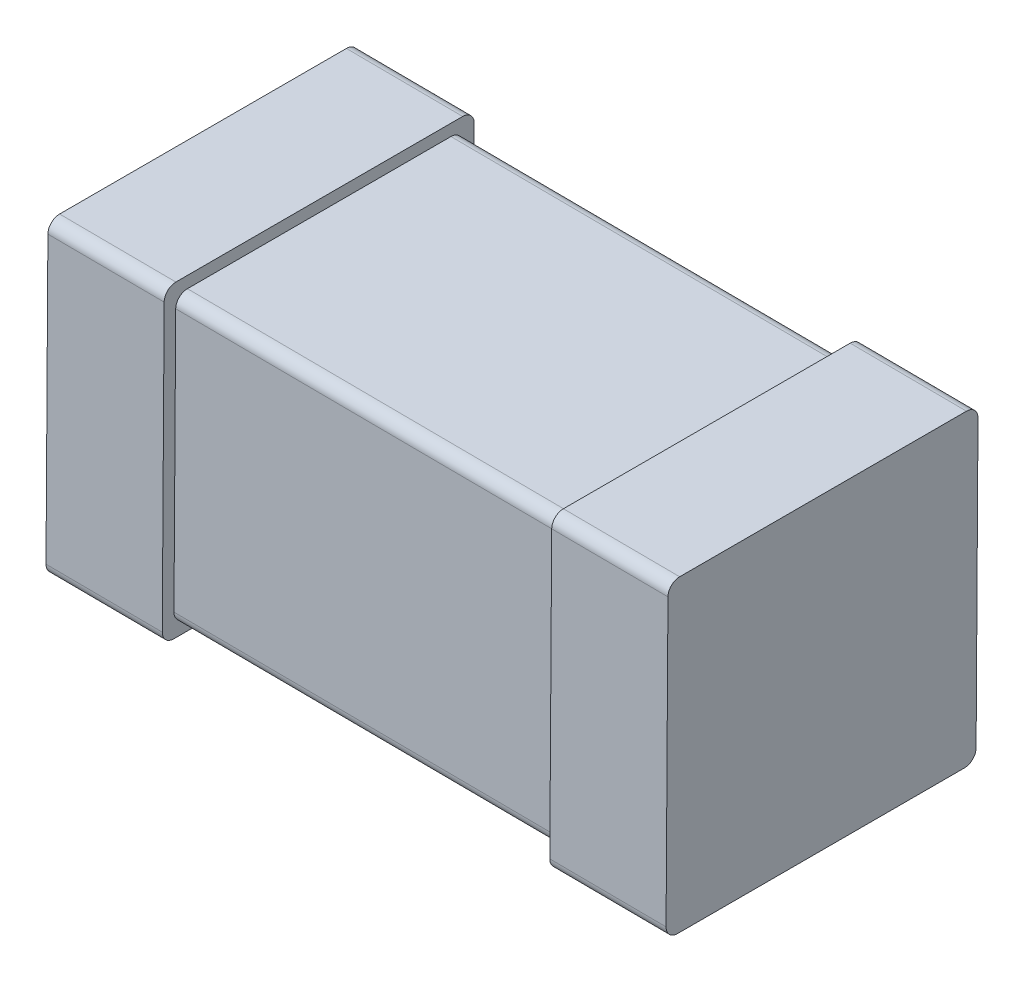
ISO-10303-21;
HEADER;
FILE_DESCRIPTION(('STEP AP214'),'2;1');
FILE_NAME('part.step','',(''),(''),'','','');
FILE_SCHEMA(('AUTOMOTIVE_DESIGN { 1 0 10303 214 1 1 1 1 }'));
ENDSEC;
DATA;
#1=APPLICATION_CONTEXT('core data for automotive mechanical design processes');
#2=APPLICATION_PROTOCOL_DEFINITION('international standard','automotive_design',2000,#1);
#3=PRODUCT_CONTEXT('',#1,'mechanical');
#4=PRODUCT('Part','Part','',(#3));
#5=PRODUCT_RELATED_PRODUCT_CATEGORY('part','',(#4));
#6=PRODUCT_DEFINITION_FORMATION('','',#4);
#7=PRODUCT_DEFINITION_CONTEXT('part definition',#1,'design');
#8=PRODUCT_DEFINITION('design','',#6,#7);
#9=PRODUCT_DEFINITION_SHAPE('','',#8);
#10=(LENGTH_UNIT() NAMED_UNIT(*) SI_UNIT(.MILLI.,.METRE.));
#11=(NAMED_UNIT(*) PLANE_ANGLE_UNIT() SI_UNIT($,.RADIAN.));
#12=(NAMED_UNIT(*) SI_UNIT($,.STERADIAN.) SOLID_ANGLE_UNIT());
#13=UNCERTAINTY_MEASURE_WITH_UNIT(LENGTH_MEASURE(1.E-05),#10,'distance_accuracy_value','');
#14=(GEOMETRIC_REPRESENTATION_CONTEXT(3) GLOBAL_UNCERTAINTY_ASSIGNED_CONTEXT((#13)) GLOBAL_UNIT_ASSIGNED_CONTEXT((#10,
#11,#12)) REPRESENTATION_CONTEXT('',''));
#15=CARTESIAN_POINT('',(0.,0.,0.));
#16=DIRECTION('',(0.,0.,1.));
#17=DIRECTION('',(1.,0.,0.));
#18=AXIS2_PLACEMENT_3D('',#15,#16,#17);
#19=CARTESIAN_POINT('',(187.003035032281,101.376564461383,142.211582908599));
#20=DIRECTION('',(0.99997801670857,-0.00663069374923689,0.));
#21=DIRECTION('',(0.,0.,-1.));
#22=AXIS2_PLACEMENT_3D('',#19,#20,#21);
#23=PLANE('',#22);
#24=DIRECTION('',(0.,0.,1.));
#25=VECTOR('',#24,1.);
#26=CARTESIAN_POINT('',(187.003035032281,101.376564461383,142.211582908599));
#27=LINE('',#26,#25);
#28=CARTESIAN_POINT('',(187.003035032281,101.376564461383,142.241582908599));
#29=VERTEX_POINT('',#28);
#30=CARTESIAN_POINT('',(187.003035032281,101.376564461383,142.981582908599));
#31=VERTEX_POINT('',#30);
#32=EDGE_CURVE('E67',#29,#31,#27,.T.);
#33=ORIENTED_EDGE('',*,*,#32,.F.);
#34=CARTESIAN_POINT('',(187.003233953094,101.406563801884,142.241582908599));
#35=DIRECTION('',(0.99997801670857,-0.00663069374923689,0.));
#36=DIRECTION('',(0.,0.,1.));
#37=AXIS2_PLACEMENT_3D('',#34,#35,#36);
#38=CIRCLE('',#37,0.0300000000000023);
#39=CARTESIAN_POINT('',(187.003233953094,101.406563801884,142.211582908599));
#40=VERTEX_POINT('',#39);
#41=EDGE_CURVE('E11',#29,#40,#38,.T.);
#42=ORIENTED_EDGE('',*,*,#41,.T.);
#43=DIRECTION('',(0.00663069374923689,0.999978016708569,0.));
#44=VECTOR('',#43,1.);
#45=CARTESIAN_POINT('',(187.003035032281,101.376564461383,142.211582908599));
#46=LINE('',#45,#44);
#47=CARTESIAN_POINT('',(187.008140666468,102.146547534249,142.211582908599));
#48=VERTEX_POINT('',#47);
#49=EDGE_CURVE('E55',#40,#48,#46,.T.);
#50=ORIENTED_EDGE('',*,*,#49,.T.);
#51=CARTESIAN_POINT('',(187.008140666468,102.146547534249,142.241582908599));
#52=DIRECTION('',(-0.99997801670857,0.00663069374923689,0.));
#53=DIRECTION('',(0.,0.,1.));
#54=AXIS2_PLACEMENT_3D('',#51,#52,#53);
#55=CIRCLE('',#54,0.0300000000000023);
#56=CARTESIAN_POINT('',(187.00833958728,102.17654687475,142.241582908599));
#57=VERTEX_POINT('',#56);
#58=EDGE_CURVE('E240',#57,#48,#55,.T.);
#59=ORIENTED_EDGE('',*,*,#58,.F.);
#60=DIRECTION('',(0.,0.,1.));
#61=VECTOR('',#60,1.);
#62=CARTESIAN_POINT('',(187.00833958728,102.17654687475,142.211582908599));
#63=LINE('',#62,#61);
#64=CARTESIAN_POINT('',(187.00833958728,102.17654687475,142.981582908599));
#65=VERTEX_POINT('',#64);
#66=EDGE_CURVE('E236',#57,#65,#63,.T.);
#67=ORIENTED_EDGE('',*,*,#66,.T.);
#68=CARTESIAN_POINT('',(187.008140666468,102.146547534249,142.981582908599));
#69=DIRECTION('',(0.99997801670857,-0.00663069374923689,0.));
#70=DIRECTION('',(0.,0.,1.));
#71=AXIS2_PLACEMENT_3D('',#68,#69,#70);
#72=CIRCLE('',#71,0.0300000000000023);
#73=CARTESIAN_POINT('',(187.008140666468,102.146547534249,143.011582908599));
#74=VERTEX_POINT('',#73);
#75=EDGE_CURVE('E226',#65,#74,#72,.T.);
#76=ORIENTED_EDGE('',*,*,#75,.T.);
#77=DIRECTION('',(0.00663069374923689,0.999978016708569,0.));
#78=VECTOR('',#77,1.);
#79=CARTESIAN_POINT('',(187.003035032281,101.376564461383,143.011582908599));
#80=LINE('',#79,#78);
#81=CARTESIAN_POINT('',(187.003233953094,101.406563801884,143.011582908599));
#82=VERTEX_POINT('',#81);
#83=EDGE_CURVE('E357',#82,#74,#80,.T.);
#84=ORIENTED_EDGE('',*,*,#83,.F.);
#85=CARTESIAN_POINT('',(187.003233953094,101.406563801884,142.981582908599));
#86=DIRECTION('',(-0.99997801670857,0.00663069374923689,0.));
#87=DIRECTION('',(0.,0.,1.));
#88=AXIS2_PLACEMENT_3D('',#85,#86,#87);
#89=CIRCLE('',#88,0.0300000000000023);
#90=EDGE_CURVE('E404',#31,#82,#89,.T.);
#91=ORIENTED_EDGE('',*,*,#90,.F.);
#92=EDGE_LOOP('',(#33,#42,#50,#59,#67,#76,#84,#91));
#93=FACE_BOUND('',#92,.T.);
#94=ADVANCED_FACE('F44',(#93),#23,.T.);
#95=CARTESIAN_POINT('',(186.708346182268,102.178536082875,142.211582908599));
#96=DIRECTION('',(0.00663069374923689,0.99997801670857,0.));
#97=DIRECTION('',(0.,0.,-1.));
#98=AXIS2_PLACEMENT_3D('',#95,#96,#97);
#99=PLANE('',#98);
#100=ORIENTED_EDGE('',*,*,#66,.F.);
#101=DIRECTION('',(0.999978016708569,-0.00663069374923689,0.));
#102=VECTOR('',#101,1.);
#103=CARTESIAN_POINT('',(186.708346182268,102.178536082875,142.241582908599));
#104=LINE('',#103,#102);
#105=CARTESIAN_POINT('',(186.708346182268,102.178536082875,142.241582908599));
#106=VERTEX_POINT('',#105);
#107=EDGE_CURVE('E304',#106,#57,#104,.T.);
#108=ORIENTED_EDGE('',*,*,#107,.F.);
#109=DIRECTION('',(0.,0.,1.));
#110=VECTOR('',#109,1.);
#111=CARTESIAN_POINT('',(186.708346182268,102.178536082875,142.211582908599));
#112=LINE('',#111,#110);
#113=CARTESIAN_POINT('',(186.708346182268,102.178536082875,142.981582908599));
#114=VERTEX_POINT('',#113);
#115=EDGE_CURVE('E237',#106,#114,#112,.T.);
#116=ORIENTED_EDGE('',*,*,#115,.T.);
#117=DIRECTION('',(0.999978016708569,-0.00663069374923689,0.));
#118=VECTOR('',#117,1.);
#119=CARTESIAN_POINT('',(186.708346182268,102.178536082875,142.981582908599));
#120=LINE('',#119,#118);
#121=EDGE_CURVE('E231',#114,#65,#120,.T.);
#122=ORIENTED_EDGE('',*,*,#121,.T.);
#123=EDGE_LOOP('',(#100,#108,#116,#122));
#124=FACE_BOUND('',#123,.T.);
#125=ADVANCED_FACE('F245',(#124),#99,.T.);
#126=CARTESIAN_POINT('',(186.708147261456,102.148536742374,142.981582908599));
#127=DIRECTION('',(0.999978016708567,-0.00663069374962122,0.));
#128=DIRECTION('',(0.00663069374962122,0.999978016708567,0.));
#129=AXIS2_PLACEMENT_3D('',#126,#127,#128);
#130=CYLINDRICAL_SURFACE('',#129,0.0299999999999979);
#131=CARTESIAN_POINT('',(186.708147261456,102.148536742374,142.981582908599));
#132=DIRECTION('',(0.99997801670857,-0.00663069374923689,0.));
#133=DIRECTION('',(0.,0.,1.));
#134=AXIS2_PLACEMENT_3D('',#131,#132,#133);
#135=CIRCLE('',#134,0.0300000000000023);
#136=CARTESIAN_POINT('',(186.708147261456,102.148536742374,143.011582908599));
#137=VERTEX_POINT('',#136);
#138=EDGE_CURVE('E249',#114,#137,#135,.T.);
#139=ORIENTED_EDGE('',*,*,#138,.T.);
#140=DIRECTION('',(0.999978016708569,-0.00663069374923689,0.));
#141=VECTOR('',#140,1.);
#142=CARTESIAN_POINT('',(186.708147261456,102.148536742374,143.011582908599));
#143=LINE('',#142,#141);
#144=EDGE_CURVE('E233',#137,#74,#143,.T.);
#145=ORIENTED_EDGE('',*,*,#144,.T.);
#146=ORIENTED_EDGE('',*,*,#75,.F.);
#147=ORIENTED_EDGE('',*,*,#121,.F.);
#148=EDGE_LOOP('',(#139,#145,#146,#147));
#149=FACE_BOUND('',#148,.T.);
#150=ADVANCED_FACE('F229',(#149),#130,.T.);
#151=CARTESIAN_POINT('',(186.708147261456,102.148536742374,142.241582908599));
#152=DIRECTION('',(0.999978016708567,-0.00663069374962122,0.));
#153=DIRECTION('',(0.00663069374962122,0.999978016708567,0.));
#154=AXIS2_PLACEMENT_3D('',#151,#152,#153);
#155=CYLINDRICAL_SURFACE('',#154,0.0299999999999979);
#156=ORIENTED_EDGE('',*,*,#107,.T.);
#157=ORIENTED_EDGE('',*,*,#58,.T.);
#158=DIRECTION('',(0.999978016708569,-0.00663069374923689,0.));
#159=VECTOR('',#158,1.);
#160=CARTESIAN_POINT('',(186.708147261456,102.148536742374,142.211582908599));
#161=LINE('',#160,#159);
#162=CARTESIAN_POINT('',(186.708147261456,102.148536742374,142.211582908599));
#163=VERTEX_POINT('',#162);
#164=EDGE_CURVE('E282',#163,#48,#161,.T.);
#165=ORIENTED_EDGE('',*,*,#164,.F.);
#166=CARTESIAN_POINT('',(186.708147261456,102.148536742374,142.241582908599));
#167=DIRECTION('',(-0.99997801670857,0.00663069374923689,0.));
#168=DIRECTION('',(0.,0.,1.));
#169=AXIS2_PLACEMENT_3D('',#166,#167,#168);
#170=CIRCLE('',#169,0.0300000000000023);
#171=EDGE_CURVE('E380',#106,#163,#170,.T.);
#172=ORIENTED_EDGE('',*,*,#171,.F.);
#173=EDGE_LOOP('',(#156,#157,#165,#172));
#174=FACE_BOUND('',#173,.T.);
#175=ADVANCED_FACE('F647',(#174),#155,.T.);
#176=CARTESIAN_POINT('',(186.703041627269,101.378553669508,143.011582908599));
#177=DIRECTION('',(0.,0.,1.));
#178=DIRECTION('',(1.,0.,0.));
#179=AXIS2_PLACEMENT_3D('',#176,#177,#178);
#180=PLANE('',#179);
#181=DIRECTION('',(0.00663069374923689,0.999978016708569,0.));
#182=VECTOR('',#181,1.);
#183=CARTESIAN_POINT('',(186.703041627269,101.378553669508,143.011582908599));
#184=LINE('',#183,#182);
#185=CARTESIAN_POINT('',(186.703240548081,101.408553010009,143.011582908599));
#186=VERTEX_POINT('',#185);
#187=EDGE_CURVE('E407',#186,#137,#184,.T.);
#188=ORIENTED_EDGE('',*,*,#187,.F.);
#189=DIRECTION('',(0.999978016708569,-0.00663069374923689,0.));
#190=VECTOR('',#189,1.);
#191=CARTESIAN_POINT('',(186.703240548081,101.408553010009,143.011582908599));
#192=LINE('',#191,#190);
#193=EDGE_CURVE('E354',#186,#82,#192,.T.);
#194=ORIENTED_EDGE('',*,*,#193,.T.);
#195=ORIENTED_EDGE('',*,*,#83,.T.);
#196=ORIENTED_EDGE('',*,*,#144,.F.);
#197=EDGE_LOOP('',(#188,#194,#195,#196));
#198=FACE_BOUND('',#197,.T.);
#199=ADVANCED_FACE('F556',(#198),#180,.T.);
#200=CARTESIAN_POINT('',(186.703041627269,101.378553669508,142.211582908599));
#201=DIRECTION('',(0.,0.,1.));
#202=DIRECTION('',(1.,0.,0.));
#203=AXIS2_PLACEMENT_3D('',#200,#201,#202);
#204=PLANE('',#203);
#205=ORIENTED_EDGE('',*,*,#164,.T.);
#206=ORIENTED_EDGE('',*,*,#49,.F.);
#207=DIRECTION('',(0.999978016708569,-0.00663069374923689,0.));
#208=VECTOR('',#207,1.);
#209=CARTESIAN_POINT('',(186.703240548081,101.408553010009,142.211582908599));
#210=LINE('',#209,#208);
#211=CARTESIAN_POINT('',(186.703240548081,101.408553010009,142.211582908599));
#212=VERTEX_POINT('',#211);
#213=EDGE_CURVE('E396',#212,#40,#210,.T.);
#214=ORIENTED_EDGE('',*,*,#213,.F.);
#215=DIRECTION('',(0.00663069374923689,0.999978016708569,0.));
#216=VECTOR('',#215,1.);
#217=CARTESIAN_POINT('',(186.703041627269,101.378553669508,142.211582908599));
#218=LINE('',#217,#216);
#219=EDGE_CURVE('E278',#212,#163,#218,.T.);
#220=ORIENTED_EDGE('',*,*,#219,.T.);
#221=EDGE_LOOP('',(#205,#206,#214,#220));
#222=FACE_BOUND('',#221,.T.);
#223=ADVANCED_FACE('F646',(#222),#204,.F.);
#224=CARTESIAN_POINT('',(186.703240548081,101.408553010009,142.981582908599));
#225=DIRECTION('',(0.999978016708567,-0.00663069374962122,0.));
#226=DIRECTION('',(-0.00663069374962122,-0.999978016708567,0.));
#227=AXIS2_PLACEMENT_3D('',#224,#225,#226);
#228=CYLINDRICAL_SURFACE('',#227,0.0299999999999979);
#229=DIRECTION('',(0.999978016708569,-0.00663069374923689,0.));
#230=VECTOR('',#229,1.);
#231=CARTESIAN_POINT('',(186.703041627269,101.378553669508,142.981582908599));
#232=LINE('',#231,#230);
#233=CARTESIAN_POINT('',(186.703041627269,101.378553669508,142.981582908599));
#234=VERTEX_POINT('',#233);
#235=EDGE_CURVE('E283',#234,#31,#232,.T.);
#236=ORIENTED_EDGE('',*,*,#235,.T.);
#237=ORIENTED_EDGE('',*,*,#90,.T.);
#238=ORIENTED_EDGE('',*,*,#193,.F.);
#239=CARTESIAN_POINT('',(186.703240548081,101.408553010009,142.981582908599));
#240=DIRECTION('',(-0.99997801670857,0.00663069374923689,0.));
#241=DIRECTION('',(0.,0.,1.));
#242=AXIS2_PLACEMENT_3D('',#239,#240,#241);
#243=CIRCLE('',#242,0.0300000000000023);
#244=EDGE_CURVE('E315',#234,#186,#243,.T.);
#245=ORIENTED_EDGE('',*,*,#244,.F.);
#246=EDGE_LOOP('',(#236,#237,#238,#245));
#247=FACE_BOUND('',#246,.T.);
#248=ADVANCED_FACE('F551',(#247),#228,.T.);
#249=CARTESIAN_POINT('',(186.703240548081,101.408553010009,142.241582908599));
#250=DIRECTION('',(0.999978016708567,-0.00663069374962122,0.));
#251=DIRECTION('',(-0.00663069374962122,-0.999978016708567,0.));
#252=AXIS2_PLACEMENT_3D('',#249,#250,#251);
#253=CYLINDRICAL_SURFACE('',#252,0.0299999999999979);
#254=CARTESIAN_POINT('',(186.703240548081,101.408553010009,142.241582908599));
#255=DIRECTION('',(0.99997801670857,-0.00663069374923689,0.));
#256=DIRECTION('',(0.,0.,1.));
#257=AXIS2_PLACEMENT_3D('',#254,#255,#256);
#258=CIRCLE('',#257,0.0300000000000023);
#259=CARTESIAN_POINT('',(186.703041627269,101.378553669508,142.241582908599));
#260=VERTEX_POINT('',#259);
#261=EDGE_CURVE('E400',#260,#212,#258,.T.);
#262=ORIENTED_EDGE('',*,*,#261,.T.);
#263=ORIENTED_EDGE('',*,*,#213,.T.);
#264=ORIENTED_EDGE('',*,*,#41,.F.);
#265=DIRECTION('',(0.999978016708569,-0.00663069374923689,0.));
#266=VECTOR('',#265,1.);
#267=CARTESIAN_POINT('',(186.703041627269,101.378553669508,142.241582908599));
#268=LINE('',#267,#266);
#269=EDGE_CURVE('E314',#260,#29,#268,.T.);
#270=ORIENTED_EDGE('',*,*,#269,.F.);
#271=EDGE_LOOP('',(#262,#263,#264,#270));
#272=FACE_BOUND('',#271,.T.);
#273=ADVANCED_FACE('F705',(#272),#253,.T.);
#274=CARTESIAN_POINT('',(186.703041627269,101.378553669508,142.211582908599));
#275=DIRECTION('',(0.00663069374923689,0.99997801670857,0.));
#276=DIRECTION('',(0.,0.,-1.));
#277=AXIS2_PLACEMENT_3D('',#274,#275,#276);
#278=PLANE('',#277);
#279=ORIENTED_EDGE('',*,*,#235,.F.);
#280=DIRECTION('',(0.,0.,1.));
#281=VECTOR('',#280,1.);
#282=CARTESIAN_POINT('',(186.703041627269,101.378553669508,142.211582908599));
#283=LINE('',#282,#281);
#284=EDGE_CURVE('E376',#260,#234,#283,.T.);
#285=ORIENTED_EDGE('',*,*,#284,.F.);
#286=ORIENTED_EDGE('',*,*,#269,.T.);
#287=ORIENTED_EDGE('',*,*,#32,.T.);
#288=EDGE_LOOP('',(#279,#285,#286,#287));
#289=FACE_BOUND('',#288,.T.);
#290=ADVANCED_FACE('F562',(#289),#278,.F.);
#291=CARTESIAN_POINT('',(186.703041627269,101.378553669508,142.211582908599));
#292=DIRECTION('',(0.99997801670857,-0.00663069374923689,0.));
#293=DIRECTION('',(0.,0.,-1.));
#294=AXIS2_PLACEMENT_3D('',#291,#292,#293);
#295=PLANE('',#294);
#296=ORIENTED_EDGE('',*,*,#244,.T.);
#297=ORIENTED_EDGE('',*,*,#187,.T.);
#298=ORIENTED_EDGE('',*,*,#138,.F.);
#299=ORIENTED_EDGE('',*,*,#115,.F.);
#300=ORIENTED_EDGE('',*,*,#171,.T.);
#301=ORIENTED_EDGE('',*,*,#219,.F.);
#302=ORIENTED_EDGE('',*,*,#261,.F.);
#303=ORIENTED_EDGE('',*,*,#284,.T.);
#304=EDGE_LOOP('',(#296,#297,#298,#299,#300,#301,#302,#303));
#305=FACE_BOUND('',#304,.T.);
#306=DIRECTION('',(0.00663069374923689,0.999978016708569,0.));
#307=VECTOR('',#306,1.);
#308=CARTESIAN_POINT('',(186.703240548081,101.408553010009,142.241582908599));
#309=LINE('',#308,#307);
#310=CARTESIAN_POINT('',(186.703439468893,101.43855235051,142.241582908599));
#311=VERTEX_POINT('',#310);
#312=CARTESIAN_POINT('',(186.707948340643,102.118537401872,142.241582908599));
#313=VERTEX_POINT('',#312);
#314=EDGE_CURVE('E381',#311,#313,#309,.T.);
#315=ORIENTED_EDGE('',*,*,#314,.T.);
#316=CARTESIAN_POINT('',(186.707948340643,102.118537401872,142.271582908599));
#317=DIRECTION('',(-0.99997801670857,0.00663069374923689,0.));
#318=DIRECTION('',(0.,0.,1.));
#319=AXIS2_PLACEMENT_3D('',#316,#317,#318);
#320=CIRCLE('',#319,0.0300000000000023);
#321=CARTESIAN_POINT('',(186.708147261456,102.148536742374,142.271582908599));
#322=VERTEX_POINT('',#321);
#323=EDGE_CURVE('E352',#322,#313,#320,.T.);
#324=ORIENTED_EDGE('',*,*,#323,.F.);
#325=DIRECTION('',(0.,0.,1.));
#326=VECTOR('',#325,1.);
#327=CARTESIAN_POINT('',(186.708147261456,102.148536742374,142.241582908599));
#328=LINE('',#327,#326);
#329=CARTESIAN_POINT('',(186.708147261456,102.148536742374,142.951582908599));
#330=VERTEX_POINT('',#329);
#331=EDGE_CURVE('E382',#322,#330,#328,.T.);
#332=ORIENTED_EDGE('',*,*,#331,.T.);
#333=CARTESIAN_POINT('',(186.707948340643,102.118537401872,142.951582908599));
#334=DIRECTION('',(0.99997801670857,-0.00663069374923689,0.));
#335=DIRECTION('',(0.,0.,1.));
#336=AXIS2_PLACEMENT_3D('',#333,#334,#335);
#337=CIRCLE('',#336,0.0300000000000023);
#338=CARTESIAN_POINT('',(186.707948340643,102.118537401872,142.981582908599));
#339=VERTEX_POINT('',#338);
#340=EDGE_CURVE('E374',#330,#339,#337,.T.);
#341=ORIENTED_EDGE('',*,*,#340,.T.);
#342=DIRECTION('',(0.00663069374923689,0.999978016708569,0.));
#343=VECTOR('',#342,1.);
#344=CARTESIAN_POINT('',(186.703240548081,101.408553010009,142.981582908599));
#345=LINE('',#344,#343);
#346=CARTESIAN_POINT('',(186.703439468893,101.43855235051,142.981582908599));
#347=VERTEX_POINT('',#346);
#348=EDGE_CURVE('E154',#347,#339,#345,.T.);
#349=ORIENTED_EDGE('',*,*,#348,.F.);
#350=CARTESIAN_POINT('',(186.703439468893,101.43855235051,142.951582908599));
#351=DIRECTION('',(-0.99997801670857,0.00663069374923689,0.));
#352=DIRECTION('',(0.,0.,1.));
#353=AXIS2_PLACEMENT_3D('',#350,#351,#352);
#354=CIRCLE('',#353,0.0300000000000023);
#355=CARTESIAN_POINT('',(186.703240548081,101.408553010009,142.951582908599));
#356=VERTEX_POINT('',#355);
#357=EDGE_CURVE('E277',#356,#347,#354,.T.);
#358=ORIENTED_EDGE('',*,*,#357,.F.);
#359=DIRECTION('',(0.,0.,1.));
#360=VECTOR('',#359,1.);
#361=CARTESIAN_POINT('',(186.703240548081,101.408553010009,142.241582908599));
#362=LINE('',#361,#360);
#363=CARTESIAN_POINT('',(186.703240548081,101.408553010009,142.271582908599));
#364=VERTEX_POINT('',#363);
#365=EDGE_CURVE('E276',#364,#356,#362,.T.);
#366=ORIENTED_EDGE('',*,*,#365,.F.);
#367=CARTESIAN_POINT('',(186.703439468893,101.43855235051,142.271582908599));
#368=DIRECTION('',(0.99997801670857,-0.00663069374923689,0.));
#369=DIRECTION('',(0.,0.,1.));
#370=AXIS2_PLACEMENT_3D('',#367,#368,#369);
#371=CIRCLE('',#370,0.0300000000000023);
#372=EDGE_CURVE('E370',#364,#311,#371,.T.);
#373=ORIENTED_EDGE('',*,*,#372,.T.);
#374=EDGE_LOOP('',(#315,#324,#332,#341,#349,#358,#366,#373));
#375=FACE_BOUND('',#374,.T.);
#376=ADVANCED_FACE('F558',(#305,#375),#295,.F.);
#377=CARTESIAN_POINT('',(185.703262531372,101.415183703758,142.241582908599));
#378=DIRECTION('',(0.00663069374923689,0.99997801670857,0.));
#379=DIRECTION('',(0.,0.,-1.));
#380=AXIS2_PLACEMENT_3D('',#377,#378,#379);
#381=PLANE('',#380);
#382=DIRECTION('',(0.999978016708569,-0.00663069374923689,0.));
#383=VECTOR('',#382,1.);
#384=CARTESIAN_POINT('',(185.703262531372,101.415183703758,142.951582908599));
#385=LINE('',#384,#383);
#386=CARTESIAN_POINT('',(185.703262531372,101.415183703758,142.951582908599));
#387=VERTEX_POINT('',#386);
#388=EDGE_CURVE('E272',#387,#356,#385,.T.);
#389=ORIENTED_EDGE('',*,*,#388,.F.);
#390=DIRECTION('',(0.,0.,1.));
#391=VECTOR('',#390,1.);
#392=CARTESIAN_POINT('',(185.703262531372,101.415183703758,142.241582908599));
#393=LINE('',#392,#391);
#394=CARTESIAN_POINT('',(185.703262531372,101.415183703758,142.271582908599));
#395=VERTEX_POINT('',#394);
#396=EDGE_CURVE('E316',#395,#387,#393,.T.);
#397=ORIENTED_EDGE('',*,*,#396,.F.);
#398=DIRECTION('',(0.999978016708569,-0.00663069374923689,0.));
#399=VECTOR('',#398,1.);
#400=CARTESIAN_POINT('',(185.703262531372,101.415183703758,142.271582908599));
#401=LINE('',#400,#399);
#402=EDGE_CURVE('E375',#395,#364,#401,.T.);
#403=ORIENTED_EDGE('',*,*,#402,.T.);
#404=ORIENTED_EDGE('',*,*,#365,.T.);
#405=EDGE_LOOP('',(#389,#397,#403,#404));
#406=FACE_BOUND('',#405,.T.);
#407=ADVANCED_FACE('F608',(#406),#381,.F.);
#408=CARTESIAN_POINT('',(185.703461452185,101.44518304426,142.951582908599));
#409=DIRECTION('',(0.999978016708567,-0.00663069374962122,0.));
#410=DIRECTION('',(-0.00663069374962122,-0.999978016708567,0.));
#411=AXIS2_PLACEMENT_3D('',#408,#409,#410);
#412=CYLINDRICAL_SURFACE('',#411,0.0299999999999979);
#413=ORIENTED_EDGE('',*,*,#388,.T.);
#414=ORIENTED_EDGE('',*,*,#357,.T.);
#415=DIRECTION('',(0.999978016708569,-0.00663069374923689,0.));
#416=VECTOR('',#415,1.);
#417=CARTESIAN_POINT('',(185.703461452185,101.44518304426,142.981582908599));
#418=LINE('',#417,#416);
#419=CARTESIAN_POINT('',(185.703461452185,101.44518304426,142.981582908599));
#420=VERTEX_POINT('',#419);
#421=EDGE_CURVE('E328',#420,#347,#418,.T.);
#422=ORIENTED_EDGE('',*,*,#421,.F.);
#423=CARTESIAN_POINT('',(185.703461452185,101.44518304426,142.951582908599));
#424=DIRECTION('',(-0.99997801670857,0.00663069374923689,0.));
#425=DIRECTION('',(0.,0.,1.));
#426=AXIS2_PLACEMENT_3D('',#423,#424,#425);
#427=CIRCLE('',#426,0.0300000000000023);
#428=EDGE_CURVE('E320',#387,#420,#427,.T.);
#429=ORIENTED_EDGE('',*,*,#428,.F.);
#430=EDGE_LOOP('',(#413,#414,#422,#429));
#431=FACE_BOUND('',#430,.T.);
#432=ADVANCED_FACE('F468',(#431),#412,.T.);
#433=CARTESIAN_POINT('',(185.703262531372,101.415183703758,142.981582908599));
#434=DIRECTION('',(0.,0.,1.));
#435=DIRECTION('',(1.,0.,0.));
#436=AXIS2_PLACEMENT_3D('',#433,#434,#435);
#437=PLANE('',#436);
#438=DIRECTION('',(0.00663069374923689,0.999978016708569,0.));
#439=VECTOR('',#438,1.);
#440=CARTESIAN_POINT('',(185.703262531372,101.415183703758,142.981582908599));
#441=LINE('',#440,#439);
#442=CARTESIAN_POINT('',(185.707970323934,102.125168095622,142.981582908599));
#443=VERTEX_POINT('',#442);
#444=EDGE_CURVE('E369',#420,#443,#441,.T.);
#445=ORIENTED_EDGE('',*,*,#444,.F.);
#446=ORIENTED_EDGE('',*,*,#421,.T.);
#447=ORIENTED_EDGE('',*,*,#348,.T.);
#448=DIRECTION('',(0.999978016708569,-0.00663069374923689,0.));
#449=VECTOR('',#448,1.);
#450=CARTESIAN_POINT('',(185.707970323934,102.125168095622,142.981582908599));
#451=LINE('',#450,#449);
#452=EDGE_CURVE('E311',#443,#339,#451,.T.);
#453=ORIENTED_EDGE('',*,*,#452,.F.);
#454=EDGE_LOOP('',(#445,#446,#447,#453));
#455=FACE_BOUND('',#454,.T.);
#456=ADVANCED_FACE('F469',(#455),#437,.T.);
#457=CARTESIAN_POINT('',(185.707970323934,102.125168095622,142.951582908599));
#458=DIRECTION('',(0.999978016708567,-0.00663069374962122,0.));
#459=DIRECTION('',(0.00663069374962122,0.999978016708567,0.));
#460=AXIS2_PLACEMENT_3D('',#457,#458,#459);
#461=CYLINDRICAL_SURFACE('',#460,0.0299999999999979);
#462=CARTESIAN_POINT('',(185.707970323934,102.125168095622,142.951582908599));
#463=DIRECTION('',(0.99997801670857,-0.00663069374923689,0.));
#464=DIRECTION('',(0.,0.,1.));
#465=AXIS2_PLACEMENT_3D('',#462,#463,#464);
#466=CIRCLE('',#465,0.0300000000000023);
#467=CARTESIAN_POINT('',(185.708169244747,102.155167436123,142.951582908599));
#468=VERTEX_POINT('',#467);
#469=EDGE_CURVE('E307',#468,#443,#466,.T.);
#470=ORIENTED_EDGE('',*,*,#469,.T.);
#471=ORIENTED_EDGE('',*,*,#452,.T.);
#472=ORIENTED_EDGE('',*,*,#340,.F.);
#473=DIRECTION('',(0.999978016708569,-0.00663069374923689,0.));
#474=VECTOR('',#473,1.);
#475=CARTESIAN_POINT('',(185.708169244747,102.155167436123,142.951582908599));
#476=LINE('',#475,#474);
#477=EDGE_CURVE('E284',#468,#330,#476,.T.);
#478=ORIENTED_EDGE('',*,*,#477,.F.);
#479=EDGE_LOOP('',(#470,#471,#472,#478));
#480=FACE_BOUND('',#479,.T.);
#481=ADVANCED_FACE('F472',(#480),#461,.T.);
#482=CARTESIAN_POINT('',(185.708169244747,102.155167436123,142.241582908599));
#483=DIRECTION('',(0.00663069374923689,0.99997801670857,0.));
#484=DIRECTION('',(0.,0.,-1.));
#485=AXIS2_PLACEMENT_3D('',#482,#483,#484);
#486=PLANE('',#485);
#487=ORIENTED_EDGE('',*,*,#331,.F.);
#488=DIRECTION('',(0.999978016708569,-0.00663069374923689,0.));
#489=VECTOR('',#488,1.);
#490=CARTESIAN_POINT('',(185.708169244747,102.155167436123,142.271582908599));
#491=LINE('',#490,#489);
#492=CARTESIAN_POINT('',(185.708169244747,102.155167436123,142.271582908599));
#493=VERTEX_POINT('',#492);
#494=EDGE_CURVE('E289',#493,#322,#491,.T.);
#495=ORIENTED_EDGE('',*,*,#494,.F.);
#496=DIRECTION('',(0.,0.,1.));
#497=VECTOR('',#496,1.);
#498=CARTESIAN_POINT('',(185.708169244747,102.155167436123,142.241582908599));
#499=LINE('',#498,#497);
#500=EDGE_CURVE('E288',#493,#468,#499,.T.);
#501=ORIENTED_EDGE('',*,*,#500,.T.);
#502=ORIENTED_EDGE('',*,*,#477,.T.);
#503=EDGE_LOOP('',(#487,#495,#501,#502));
#504=FACE_BOUND('',#503,.T.);
#505=ADVANCED_FACE('F480',(#504),#486,.T.);
#506=CARTESIAN_POINT('',(185.707970323934,102.125168095622,142.271582908599));
#507=DIRECTION('',(0.999978016708567,-0.00663069374962122,0.));
#508=DIRECTION('',(0.00663069374962122,0.999978016708567,0.));
#509=AXIS2_PLACEMENT_3D('',#506,#507,#508);
#510=CYLINDRICAL_SURFACE('',#509,0.0299999999999979);
#511=ORIENTED_EDGE('',*,*,#494,.T.);
#512=ORIENTED_EDGE('',*,*,#323,.T.);
#513=DIRECTION('',(0.999978016708569,-0.00663069374923689,0.));
#514=VECTOR('',#513,1.);
#515=CARTESIAN_POINT('',(185.707970323934,102.125168095622,142.241582908599));
#516=LINE('',#515,#514);
#517=CARTESIAN_POINT('',(185.707970323934,102.125168095622,142.241582908599));
#518=VERTEX_POINT('',#517);
#519=EDGE_CURVE('E364',#518,#313,#516,.T.);
#520=ORIENTED_EDGE('',*,*,#519,.F.);
#521=CARTESIAN_POINT('',(185.707970323934,102.125168095622,142.271582908599));
#522=DIRECTION('',(-0.99997801670857,0.00663069374923689,0.));
#523=DIRECTION('',(0.,0.,1.));
#524=AXIS2_PLACEMENT_3D('',#521,#522,#523);
#525=CIRCLE('',#524,0.0300000000000023);
#526=EDGE_CURVE('E366',#493,#518,#525,.T.);
#527=ORIENTED_EDGE('',*,*,#526,.F.);
#528=EDGE_LOOP('',(#511,#512,#520,#527));
#529=FACE_BOUND('',#528,.T.);
#530=ADVANCED_FACE('F597',(#529),#510,.T.);
#531=CARTESIAN_POINT('',(185.703262531372,101.415183703758,142.241582908599));
#532=DIRECTION('',(0.,0.,1.));
#533=DIRECTION('',(1.,0.,0.));
#534=AXIS2_PLACEMENT_3D('',#531,#532,#533);
#535=PLANE('',#534);
#536=ORIENTED_EDGE('',*,*,#519,.T.);
#537=ORIENTED_EDGE('',*,*,#314,.F.);
#538=DIRECTION('',(0.999978016708569,-0.00663069374923689,0.));
#539=VECTOR('',#538,1.);
#540=CARTESIAN_POINT('',(185.703461452185,101.44518304426,142.241582908599));
#541=LINE('',#540,#539);
#542=CARTESIAN_POINT('',(185.703461452185,101.44518304426,142.241582908599));
#543=VERTEX_POINT('',#542);
#544=EDGE_CURVE('E439',#543,#311,#541,.T.);
#545=ORIENTED_EDGE('',*,*,#544,.F.);
#546=DIRECTION('',(0.00663069374923689,0.999978016708569,0.));
#547=VECTOR('',#546,1.);
#548=CARTESIAN_POINT('',(185.703262531372,101.415183703758,142.241582908599));
#549=LINE('',#548,#547);
#550=EDGE_CURVE('E360',#543,#518,#549,.T.);
#551=ORIENTED_EDGE('',*,*,#550,.T.);
#552=EDGE_LOOP('',(#536,#537,#545,#551));
#553=FACE_BOUND('',#552,.T.);
#554=ADVANCED_FACE('F602',(#553),#535,.F.);
#555=CARTESIAN_POINT('',(185.703461452185,101.44518304426,142.271582908599));
#556=DIRECTION('',(0.999978016708567,-0.00663069374962122,0.));
#557=DIRECTION('',(-0.00663069374962122,-0.999978016708567,0.));
#558=AXIS2_PLACEMENT_3D('',#555,#556,#557);
#559=CYLINDRICAL_SURFACE('',#558,0.0299999999999979);
#560=CARTESIAN_POINT('',(185.703461452185,101.44518304426,142.271582908599));
#561=DIRECTION('',(0.99997801670857,-0.00663069374923689,0.));
#562=DIRECTION('',(0.,0.,1.));
#563=AXIS2_PLACEMENT_3D('',#560,#561,#562);
#564=CIRCLE('',#563,0.0300000000000023);
#565=EDGE_CURVE('E365',#395,#543,#564,.T.);
#566=ORIENTED_EDGE('',*,*,#565,.T.);
#567=ORIENTED_EDGE('',*,*,#544,.T.);
#568=ORIENTED_EDGE('',*,*,#372,.F.);
#569=ORIENTED_EDGE('',*,*,#402,.F.);
#570=EDGE_LOOP('',(#566,#567,#568,#569));
#571=FACE_BOUND('',#570,.T.);
#572=ADVANCED_FACE('F606',(#571),#559,.T.);
#573=CARTESIAN_POINT('',(185.70306361056,101.385184363257,142.211582908599));
#574=DIRECTION('',(0.99997801670857,-0.00663069374923689,0.));
#575=DIRECTION('',(0.,0.,-1.));
#576=AXIS2_PLACEMENT_3D('',#573,#574,#575);
#577=PLANE('',#576);
#578=DIRECTION('',(0.,0.,1.));
#579=VECTOR('',#578,1.);
#580=CARTESIAN_POINT('',(185.70306361056,101.385184363257,142.211582908599));
#581=LINE('',#580,#579);
#582=CARTESIAN_POINT('',(185.70306361056,101.385184363257,142.241582908599));
#583=VERTEX_POINT('',#582);
#584=CARTESIAN_POINT('',(185.70306361056,101.385184363257,142.981582908599));
#585=VERTEX_POINT('',#584);
#586=EDGE_CURVE('E413',#583,#585,#581,.T.);
#587=ORIENTED_EDGE('',*,*,#586,.F.);
#588=CARTESIAN_POINT('',(185.703262531372,101.415183703758,142.241582908599));
#589=DIRECTION('',(0.99997801670857,-0.00663069374923689,0.));
#590=DIRECTION('',(0.,0.,1.));
#591=AXIS2_PLACEMENT_3D('',#588,#589,#590);
#592=CIRCLE('',#591,0.0300000000000023);
#593=CARTESIAN_POINT('',(185.703262531372,101.415183703758,142.211582908599));
#594=VERTEX_POINT('',#593);
#595=EDGE_CURVE('E392',#583,#594,#592,.T.);
#596=ORIENTED_EDGE('',*,*,#595,.T.);
#597=DIRECTION('',(0.00663069374923689,0.999978016708569,0.));
#598=VECTOR('',#597,1.);
#599=CARTESIAN_POINT('',(185.70306361056,101.385184363257,142.211582908599));
#600=LINE('',#599,#598);
#601=CARTESIAN_POINT('',(185.708169244747,102.155167436123,142.211582908599));
#602=VERTEX_POINT('',#601);
#603=EDGE_CURVE('E265',#594,#602,#600,.T.);
#604=ORIENTED_EDGE('',*,*,#603,.T.);
#605=CARTESIAN_POINT('',(185.708169244747,102.155167436123,142.241582908599));
#606=DIRECTION('',(-0.99997801670857,0.00663069374923689,0.));
#607=DIRECTION('',(0.,0.,1.));
#608=AXIS2_PLACEMENT_3D('',#605,#606,#607);
#609=CIRCLE('',#608,0.0300000000000023);
#610=CARTESIAN_POINT('',(185.70836816556,102.185166776624,142.241582908599));
#611=VERTEX_POINT('',#610);
#612=EDGE_CURVE('E321',#611,#602,#609,.T.);
#613=ORIENTED_EDGE('',*,*,#612,.F.);
#614=DIRECTION('',(0.,0.,1.));
#615=VECTOR('',#614,1.);
#616=CARTESIAN_POINT('',(185.70836816556,102.185166776624,142.211582908599));
#617=LINE('',#616,#615);
#618=CARTESIAN_POINT('',(185.70836816556,102.185166776624,142.981582908599));
#619=VERTEX_POINT('',#618);
#620=EDGE_CURVE('E262',#611,#619,#617,.T.);
#621=ORIENTED_EDGE('',*,*,#620,.T.);
#622=CARTESIAN_POINT('',(185.708169244747,102.155167436123,142.981582908599));
#623=DIRECTION('',(0.99997801670857,-0.00663069374923689,0.));
#624=DIRECTION('',(0.,0.,1.));
#625=AXIS2_PLACEMENT_3D('',#622,#623,#624);
#626=CIRCLE('',#625,0.0300000000000023);
#627=CARTESIAN_POINT('',(185.708169244747,102.155167436123,143.011582908599));
#628=VERTEX_POINT('',#627);
#629=EDGE_CURVE('E260',#619,#628,#626,.T.);
#630=ORIENTED_EDGE('',*,*,#629,.T.);
#631=DIRECTION('',(0.00663069374923689,0.999978016708569,0.));
#632=VECTOR('',#631,1.);
#633=CARTESIAN_POINT('',(185.70306361056,101.385184363257,143.011582908599));
#634=LINE('',#633,#632);
#635=CARTESIAN_POINT('',(185.703262531372,101.415183703758,143.011582908599));
#636=VERTEX_POINT('',#635);
#637=EDGE_CURVE('E290',#636,#628,#634,.T.);
#638=ORIENTED_EDGE('',*,*,#637,.F.);
#639=CARTESIAN_POINT('',(185.703262531372,101.415183703758,142.981582908599));
#640=DIRECTION('',(-0.99997801670857,0.00663069374923689,0.));
#641=DIRECTION('',(0.,0.,1.));
#642=AXIS2_PLACEMENT_3D('',#639,#640,#641);
#643=CIRCLE('',#642,0.0300000000000023);
#644=EDGE_CURVE('E48',#585,#636,#643,.T.);
#645=ORIENTED_EDGE('',*,*,#644,.F.);
#646=EDGE_LOOP('',(#587,#596,#604,#613,#621,#630,#638,#645));
#647=FACE_BOUND('',#646,.T.);
#648=ORIENTED_EDGE('',*,*,#565,.F.);
#649=ORIENTED_EDGE('',*,*,#396,.T.);
#650=ORIENTED_EDGE('',*,*,#428,.T.);
#651=ORIENTED_EDGE('',*,*,#444,.T.);
#652=ORIENTED_EDGE('',*,*,#469,.F.);
#653=ORIENTED_EDGE('',*,*,#500,.F.);
#654=ORIENTED_EDGE('',*,*,#526,.T.);
#655=ORIENTED_EDGE('',*,*,#550,.F.);
#656=EDGE_LOOP('',(#648,#649,#650,#651,#652,#653,#654,#655));
#657=FACE_BOUND('',#656,.T.);
#658=ADVANCED_FACE('F459',(#647,#657),#577,.T.);
#659=CARTESIAN_POINT('',(185.408374760547,102.187155984749,142.211582908599));
#660=DIRECTION('',(0.00663069374923689,0.99997801670857,0.));
#661=DIRECTION('',(0.,0.,-1.));
#662=AXIS2_PLACEMENT_3D('',#659,#660,#661);
#663=PLANE('',#662);
#664=ORIENTED_EDGE('',*,*,#620,.F.);
#665=DIRECTION('',(0.999978016708569,-0.00663069374923689,0.));
#666=VECTOR('',#665,1.);
#667=CARTESIAN_POINT('',(185.408374760547,102.187155984749,142.241582908599));
#668=LINE('',#667,#666);
#669=CARTESIAN_POINT('',(185.408374760547,102.187155984749,142.241582908599));
#670=VERTEX_POINT('',#669);
#671=EDGE_CURVE('E325',#670,#611,#668,.T.);
#672=ORIENTED_EDGE('',*,*,#671,.F.);
#673=DIRECTION('',(0.,0.,1.));
#674=VECTOR('',#673,1.);
#675=CARTESIAN_POINT('',(185.408374760547,102.187155984749,142.211582908599));
#676=LINE('',#675,#674);
#677=CARTESIAN_POINT('',(185.408374760547,102.187155984749,142.981582908599));
#678=VERTEX_POINT('',#677);
#679=EDGE_CURVE('E340',#670,#678,#676,.T.);
#680=ORIENTED_EDGE('',*,*,#679,.T.);
#681=DIRECTION('',(0.999978016708569,-0.00663069374923689,0.));
#682=VECTOR('',#681,1.);
#683=CARTESIAN_POINT('',(185.408374760547,102.187155984749,142.981582908599));
#684=LINE('',#683,#682);
#685=EDGE_CURVE('E332',#678,#619,#684,.T.);
#686=ORIENTED_EDGE('',*,*,#685,.T.);
#687=EDGE_LOOP('',(#664,#672,#680,#686));
#688=FACE_BOUND('',#687,.T.);
#689=ADVANCED_FACE('F636',(#688),#663,.T.);
#690=CARTESIAN_POINT('',(185.408175839734,102.157156644248,142.981582908599));
#691=DIRECTION('',(0.999978016708567,-0.00663069374962122,0.));
#692=DIRECTION('',(0.00663069374962122,0.999978016708567,0.));
#693=AXIS2_PLACEMENT_3D('',#690,#691,#692);
#694=CYLINDRICAL_SURFACE('',#693,0.0299999999999979);
#695=CARTESIAN_POINT('',(185.408175839734,102.157156644248,142.981582908599));
#696=DIRECTION('',(0.99997801670857,-0.00663069374923689,0.));
#697=DIRECTION('',(0.,0.,1.));
#698=AXIS2_PLACEMENT_3D('',#695,#696,#697);
#699=CIRCLE('',#698,0.0300000000000023);
#700=CARTESIAN_POINT('',(185.408175839734,102.157156644248,143.011582908599));
#701=VERTEX_POINT('',#700);
#702=EDGE_CURVE('E329',#678,#701,#699,.T.);
#703=ORIENTED_EDGE('',*,*,#702,.T.);
#704=DIRECTION('',(0.999978016708569,-0.00663069374923689,0.));
#705=VECTOR('',#704,1.);
#706=CARTESIAN_POINT('',(185.408175839734,102.157156644248,143.011582908599));
#707=LINE('',#706,#705);
#708=EDGE_CURVE('E333',#701,#628,#707,.T.);
#709=ORIENTED_EDGE('',*,*,#708,.T.);
#710=ORIENTED_EDGE('',*,*,#629,.F.);
#711=ORIENTED_EDGE('',*,*,#685,.F.);
#712=EDGE_LOOP('',(#703,#709,#710,#711));
#713=FACE_BOUND('',#712,.T.);
#714=ADVANCED_FACE('F812',(#713),#694,.T.);
#715=CARTESIAN_POINT('',(185.408175839734,102.157156644248,142.241582908599));
#716=DIRECTION('',(0.999978016708567,-0.00663069374962122,0.));
#717=DIRECTION('',(0.00663069374962122,0.999978016708567,0.));
#718=AXIS2_PLACEMENT_3D('',#715,#716,#717);
#719=CYLINDRICAL_SURFACE('',#718,0.0299999999999979);
#720=ORIENTED_EDGE('',*,*,#671,.T.);
#721=ORIENTED_EDGE('',*,*,#612,.T.);
#722=DIRECTION('',(0.999978016708569,-0.00663069374923689,0.));
#723=VECTOR('',#722,1.);
#724=CARTESIAN_POINT('',(185.408175839734,102.157156644248,142.211582908599));
#725=LINE('',#724,#723);
#726=CARTESIAN_POINT('',(185.408175839734,102.157156644248,142.211582908599));
#727=VERTEX_POINT('',#726);
#728=EDGE_CURVE('E295',#727,#602,#725,.T.);
#729=ORIENTED_EDGE('',*,*,#728,.F.);
#730=CARTESIAN_POINT('',(185.408175839734,102.157156644248,142.241582908599));
#731=DIRECTION('',(-0.99997801670857,0.00663069374923689,0.));
#732=DIRECTION('',(0.,0.,1.));
#733=AXIS2_PLACEMENT_3D('',#730,#731,#732);
#734=CIRCLE('',#733,0.0300000000000023);
#735=EDGE_CURVE('E271',#670,#727,#734,.T.);
#736=ORIENTED_EDGE('',*,*,#735,.F.);
#737=EDGE_LOOP('',(#720,#721,#729,#736));
#738=FACE_BOUND('',#737,.T.);
#739=ADVANCED_FACE('F520',(#738),#719,.T.);
#740=CARTESIAN_POINT('',(185.403070205547,101.387173571382,143.011582908599));
#741=DIRECTION('',(0.,0.,1.));
#742=DIRECTION('',(1.,0.,0.));
#743=AXIS2_PLACEMENT_3D('',#740,#741,#742);
#744=PLANE('',#743);
#745=DIRECTION('',(0.00663069374923689,0.999978016708569,0.));
#746=VECTOR('',#745,1.);
#747=CARTESIAN_POINT('',(185.403070205547,101.387173571382,143.011582908599));
#748=LINE('',#747,#746);
#749=CARTESIAN_POINT('',(185.40326912636,101.417172911883,143.011582908599));
#750=VERTEX_POINT('',#749);
#751=EDGE_CURVE('E266',#750,#701,#748,.T.);
#752=ORIENTED_EDGE('',*,*,#751,.F.);
#753=DIRECTION('',(0.999978016708569,-0.00663069374923689,0.));
#754=VECTOR('',#753,1.);
#755=CARTESIAN_POINT('',(185.40326912636,101.417172911883,143.011582908599));
#756=LINE('',#755,#754);
#757=EDGE_CURVE('E294',#750,#636,#756,.T.);
#758=ORIENTED_EDGE('',*,*,#757,.T.);
#759=ORIENTED_EDGE('',*,*,#637,.T.);
#760=ORIENTED_EDGE('',*,*,#708,.F.);
#761=EDGE_LOOP('',(#752,#758,#759,#760));
#762=FACE_BOUND('',#761,.T.);
#763=ADVANCED_FACE('F577',(#762),#744,.T.);
#764=CARTESIAN_POINT('',(185.403070205547,101.387173571382,142.211582908599));
#765=DIRECTION('',(0.,0.,1.));
#766=DIRECTION('',(1.,0.,0.));
#767=AXIS2_PLACEMENT_3D('',#764,#765,#766);
#768=PLANE('',#767);
#769=ORIENTED_EDGE('',*,*,#728,.T.);
#770=ORIENTED_EDGE('',*,*,#603,.F.);
#771=DIRECTION('',(0.999978016708569,-0.00663069374923689,0.));
#772=VECTOR('',#771,1.);
#773=CARTESIAN_POINT('',(185.40326912636,101.417172911883,142.211582908599));
#774=LINE('',#773,#772);
#775=CARTESIAN_POINT('',(185.40326912636,101.417172911883,142.211582908599));
#776=VERTEX_POINT('',#775);
#777=EDGE_CURVE('E412',#776,#594,#774,.T.);
#778=ORIENTED_EDGE('',*,*,#777,.F.);
#779=DIRECTION('',(0.00663069374923689,0.999978016708569,0.));
#780=VECTOR('',#779,1.);
#781=CARTESIAN_POINT('',(185.403070205547,101.387173571382,142.211582908599));
#782=LINE('',#781,#780);
#783=EDGE_CURVE('E296',#776,#727,#782,.T.);
#784=ORIENTED_EDGE('',*,*,#783,.T.);
#785=EDGE_LOOP('',(#769,#770,#778,#784));
#786=FACE_BOUND('',#785,.T.);
#787=ADVANCED_FACE('F515',(#786),#768,.F.);
#788=CARTESIAN_POINT('',(185.40326912636,101.417172911883,142.981582908599));
#789=DIRECTION('',(0.999978016708567,-0.00663069374962122,0.));
#790=DIRECTION('',(-0.00663069374962122,-0.999978016708567,0.));
#791=AXIS2_PLACEMENT_3D('',#788,#789,#790);
#792=CYLINDRICAL_SURFACE('',#791,0.0299999999999979);
#793=DIRECTION('',(0.999978016708569,-0.00663069374923689,0.));
#794=VECTOR('',#793,1.);
#795=CARTESIAN_POINT('',(185.403070205547,101.387173571382,142.981582908599));
#796=LINE('',#795,#794);
#797=CARTESIAN_POINT('',(185.403070205547,101.387173571382,142.981582908599));
#798=VERTEX_POINT('',#797);
#799=EDGE_CURVE('E300',#798,#585,#796,.T.);
#800=ORIENTED_EDGE('',*,*,#799,.T.);
#801=ORIENTED_EDGE('',*,*,#644,.T.);
#802=ORIENTED_EDGE('',*,*,#757,.F.);
#803=CARTESIAN_POINT('',(185.40326912636,101.417172911883,142.981582908599));
#804=DIRECTION('',(-0.99997801670857,0.00663069374923689,0.));
#805=DIRECTION('',(0.,0.,1.));
#806=AXIS2_PLACEMENT_3D('',#803,#804,#805);
#807=CIRCLE('',#806,0.0300000000000023);
#808=EDGE_CURVE('E270',#798,#750,#807,.T.);
#809=ORIENTED_EDGE('',*,*,#808,.F.);
#810=EDGE_LOOP('',(#800,#801,#802,#809));
#811=FACE_BOUND('',#810,.T.);
#812=ADVANCED_FACE('F579',(#811),#792,.T.);
#813=CARTESIAN_POINT('',(185.40326912636,101.417172911883,142.241582908599));
#814=DIRECTION('',(0.999978016708567,-0.00663069374962122,0.));
#815=DIRECTION('',(-0.00663069374962122,-0.999978016708567,0.));
#816=AXIS2_PLACEMENT_3D('',#813,#814,#815);
#817=CYLINDRICAL_SURFACE('',#816,0.0299999999999979);
#818=CARTESIAN_POINT('',(185.40326912636,101.417172911883,142.241582908599));
#819=DIRECTION('',(0.99997801670857,-0.00663069374923689,0.));
#820=DIRECTION('',(0.,0.,1.));
#821=AXIS2_PLACEMENT_3D('',#818,#819,#820);
#822=CIRCLE('',#821,0.0300000000000023);
#823=CARTESIAN_POINT('',(185.403070205547,101.387173571382,142.241582908599));
#824=VERTEX_POINT('',#823);
#825=EDGE_CURVE('E428',#824,#776,#822,.T.);
#826=ORIENTED_EDGE('',*,*,#825,.T.);
#827=ORIENTED_EDGE('',*,*,#777,.T.);
#828=ORIENTED_EDGE('',*,*,#595,.F.);
#829=DIRECTION('',(0.999978016708569,-0.00663069374923689,0.));
#830=VECTOR('',#829,1.);
#831=CARTESIAN_POINT('',(185.403070205547,101.387173571382,142.241582908599));
#832=LINE('',#831,#830);
#833=EDGE_CURVE('E408',#824,#583,#832,.T.);
#834=ORIENTED_EDGE('',*,*,#833,.F.);
#835=EDGE_LOOP('',(#826,#827,#828,#834));
#836=FACE_BOUND('',#835,.T.);
#837=ADVANCED_FACE('F532',(#836),#817,.T.);
#838=CARTESIAN_POINT('',(185.403070205547,101.387173571382,142.211582908599));
#839=DIRECTION('',(0.00663069374923689,0.99997801670857,0.));
#840=DIRECTION('',(0.,0.,-1.));
#841=AXIS2_PLACEMENT_3D('',#838,#839,#840);
#842=PLANE('',#841);
#843=ORIENTED_EDGE('',*,*,#799,.F.);
#844=DIRECTION('',(0.,0.,1.));
#845=VECTOR('',#844,1.);
#846=CARTESIAN_POINT('',(185.403070205547,101.387173571382,142.211582908599));
#847=LINE('',#846,#845);
#848=EDGE_CURVE('E416',#824,#798,#847,.T.);
#849=ORIENTED_EDGE('',*,*,#848,.F.);
#850=ORIENTED_EDGE('',*,*,#833,.T.);
#851=ORIENTED_EDGE('',*,*,#586,.T.);
#852=EDGE_LOOP('',(#843,#849,#850,#851));
#853=FACE_BOUND('',#852,.T.);
#854=ADVANCED_FACE('F583',(#853),#842,.F.);
#855=CARTESIAN_POINT('',(185.403070205547,101.387173571382,142.211582908599));
#856=DIRECTION('',(0.99997801670857,-0.00663069374923689,0.));
#857=DIRECTION('',(0.,0.,-1.));
#858=AXIS2_PLACEMENT_3D('',#855,#856,#857);
#859=PLANE('',#858);
#860=ORIENTED_EDGE('',*,*,#808,.T.);
#861=ORIENTED_EDGE('',*,*,#751,.T.);
#862=ORIENTED_EDGE('',*,*,#702,.F.);
#863=ORIENTED_EDGE('',*,*,#679,.F.);
#864=ORIENTED_EDGE('',*,*,#735,.T.);
#865=ORIENTED_EDGE('',*,*,#783,.F.);
#866=ORIENTED_EDGE('',*,*,#825,.F.);
#867=ORIENTED_EDGE('',*,*,#848,.T.);
#868=EDGE_LOOP('',(#860,#861,#862,#863,#864,#865,#866,#867));
#869=FACE_BOUND('',#868,.T.);
#870=ADVANCED_FACE('F46',(#869),#859,.F.);
#871=CLOSED_SHELL('',(#94,#125,#150,#175,#199,#223,#248,#273,#290,#376,#407,#432,#456,#481,#505,
#530,#554,#572,#658,#689,#714,#739,#763,#787,#812,#837,#854,#870));
#872=MANIFOLD_SOLID_BREP('B2',#871);
#873=ADVANCED_BREP_SHAPE_REPRESENTATION('',(#18,#872),#14);
#874=SHAPE_DEFINITION_REPRESENTATION(#9,#873);
ENDSEC;
END-ISO-10303-21;
